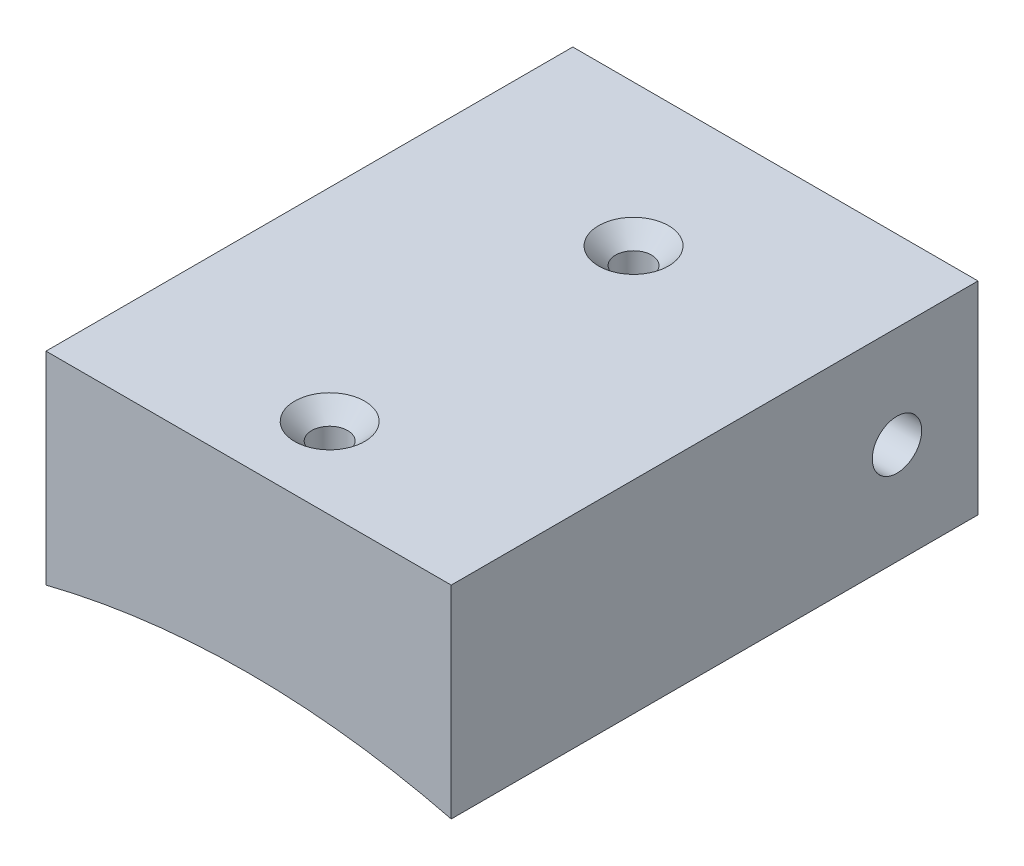
ISO-10303-21;
HEADER;
FILE_DESCRIPTION(('STEP AP214'),'2;1');
FILE_NAME('part.step','',(''),(''),'','','');
FILE_SCHEMA(('AUTOMOTIVE_DESIGN { 1 0 10303 214 1 1 1 1 }'));
ENDSEC;
DATA;
#1=APPLICATION_CONTEXT('core data for automotive mechanical design processes');
#2=APPLICATION_PROTOCOL_DEFINITION('international standard','automotive_design',2000,#1);
#3=PRODUCT_CONTEXT('',#1,'mechanical');
#4=PRODUCT('Part','Part','',(#3));
#5=PRODUCT_RELATED_PRODUCT_CATEGORY('part','',(#4));
#6=PRODUCT_DEFINITION_FORMATION('','',#4);
#7=PRODUCT_DEFINITION_CONTEXT('part definition',#1,'design');
#8=PRODUCT_DEFINITION('design','',#6,#7);
#9=PRODUCT_DEFINITION_SHAPE('','',#8);
#10=(LENGTH_UNIT() NAMED_UNIT(*) SI_UNIT(.MILLI.,.METRE.));
#11=(NAMED_UNIT(*) PLANE_ANGLE_UNIT() SI_UNIT($,.RADIAN.));
#12=(NAMED_UNIT(*) SI_UNIT($,.STERADIAN.) SOLID_ANGLE_UNIT());
#13=UNCERTAINTY_MEASURE_WITH_UNIT(LENGTH_MEASURE(1.E-05),#10,'distance_accuracy_value','');
#14=(GEOMETRIC_REPRESENTATION_CONTEXT(3) GLOBAL_UNCERTAINTY_ASSIGNED_CONTEXT((#13)) GLOBAL_UNIT_ASSIGNED_CONTEXT((#10,
#11,#12)) REPRESENTATION_CONTEXT('',''));
#15=CARTESIAN_POINT('',(0.,0.,0.));
#16=DIRECTION('',(0.,0.,1.));
#17=DIRECTION('',(1.,0.,0.));
#18=AXIS2_PLACEMENT_3D('',#15,#16,#17);
#19=CARTESIAN_POINT('',(10.,39.7782887515288,11.5));
#20=DIRECTION('',(-1.,0.,0.));
#21=DIRECTION('',(0.,-1.,0.));
#22=AXIS2_PLACEMENT_3D('',#19,#20,#21);
#23=PLANE('',#22);
#24=CARTESIAN_POINT('',(10.,44.7782887515288,-10.5));
#25=DIRECTION('',(-1.,0.,0.));
#26=DIRECTION('',(0.,0.,1.));
#27=AXIS2_PLACEMENT_3D('',#24,#25,#26);
#28=CIRCLE('',#27,1.2192);
#29=CARTESIAN_POINT('',(10.,44.7782887515288,-9.2808));
#30=VERTEX_POINT('',#29);
#31=EDGE_CURVE('E99',#30,#30,#28,.T.);
#32=ORIENTED_EDGE('',*,*,#31,.T.);
#33=EDGE_LOOP('',(#32));
#34=FACE_BOUND('',#33,.T.);
#35=DIRECTION('',(0.,0.,-1.));
#36=VECTOR('',#35,1.);
#37=CARTESIAN_POINT('',(9.99999999999999,39.7782887515288,11.5));
#38=LINE('',#37,#36);
#39=CARTESIAN_POINT('',(9.99999999999999,39.7782887515288,11.5));
#40=VERTEX_POINT('',#39);
#41=CARTESIAN_POINT('',(9.99999999999999,39.7782887515288,-14.5));
#42=VERTEX_POINT('',#41);
#43=EDGE_CURVE('E84',#40,#42,#38,.T.);
#44=ORIENTED_EDGE('',*,*,#43,.T.);
#45=DIRECTION('',(0.,-1.,0.));
#46=VECTOR('',#45,1.);
#47=CARTESIAN_POINT('',(9.99999999999999,49.7782887515288,-14.5));
#48=LINE('',#47,#46);
#49=CARTESIAN_POINT('',(9.99999999999999,49.7782887515288,-14.5));
#50=VERTEX_POINT('',#49);
#51=EDGE_CURVE('E98',#50,#42,#48,.T.);
#52=ORIENTED_EDGE('',*,*,#51,.F.);
#53=DIRECTION('',(0.,0.,-1.));
#54=VECTOR('',#53,1.);
#55=CARTESIAN_POINT('',(9.99999999999999,49.7782887515288,11.5));
#56=LINE('',#55,#54);
#57=CARTESIAN_POINT('',(9.99999999999999,49.7782887515288,11.5));
#58=VERTEX_POINT('',#57);
#59=EDGE_CURVE('E11',#58,#50,#56,.T.);
#60=ORIENTED_EDGE('',*,*,#59,.F.);
#61=DIRECTION('',(0.,1.,0.));
#62=VECTOR('',#61,1.);
#63=CARTESIAN_POINT('',(10.,39.7782887515288,11.5));
#64=LINE('',#63,#62);
#65=EDGE_CURVE('E121',#40,#58,#64,.T.);
#66=ORIENTED_EDGE('',*,*,#65,.F.);
#67=EDGE_LOOP('',(#44,#52,#60,#66));
#68=FACE_BOUND('',#67,.T.);
#69=ADVANCED_FACE('F34',(#34,#68),#23,.F.);
#70=CARTESIAN_POINT('',(-10.,49.7782887515288,11.5));
#71=DIRECTION('',(0.,-1.,0.));
#72=DIRECTION('',(0.,0.,-1.));
#73=AXIS2_PLACEMENT_3D('',#70,#71,#72);
#74=PLANE('',#73);
#75=CARTESIAN_POINT('',(0.,49.7782887515288,7.5));
#76=DIRECTION('',(0.,1.,0.));
#77=DIRECTION('',(0.,0.,1.));
#78=AXIS2_PLACEMENT_3D('',#75,#76,#77);
#79=CIRCLE('',#78,1.7272);
#80=CARTESIAN_POINT('',(0.,49.7782887515288,9.2272));
#81=VERTEX_POINT('',#80);
#82=EDGE_CURVE('E108',#81,#81,#79,.T.);
#83=ORIENTED_EDGE('',*,*,#82,.F.);
#84=EDGE_LOOP('',(#83));
#85=FACE_BOUND('',#84,.T.);
#86=CARTESIAN_POINT('',(0.,49.7782887515288,-7.5));
#87=DIRECTION('',(0.,1.,0.));
#88=DIRECTION('',(0.,0.,1.));
#89=AXIS2_PLACEMENT_3D('',#86,#87,#88);
#90=CIRCLE('',#89,1.7272);
#91=CARTESIAN_POINT('',(0.,49.7782887515288,-5.7728));
#92=VERTEX_POINT('',#91);
#93=EDGE_CURVE('E114',#92,#92,#90,.T.);
#94=ORIENTED_EDGE('',*,*,#93,.F.);
#95=EDGE_LOOP('',(#94));
#96=FACE_BOUND('',#95,.T.);
#97=ORIENTED_EDGE('',*,*,#59,.T.);
#98=DIRECTION('',(1.,0.,0.));
#99=VECTOR('',#98,1.);
#100=CARTESIAN_POINT('',(-10.,49.7782887515288,-14.5));
#101=LINE('',#100,#99);
#102=CARTESIAN_POINT('',(-10.,49.7782887515288,-14.5));
#103=VERTEX_POINT('',#102);
#104=EDGE_CURVE('E93',#103,#50,#101,.T.);
#105=ORIENTED_EDGE('',*,*,#104,.F.);
#106=DIRECTION('',(0.,0.,-1.));
#107=VECTOR('',#106,1.);
#108=CARTESIAN_POINT('',(-10.,49.7782887515288,11.5));
#109=LINE('',#108,#107);
#110=CARTESIAN_POINT('',(-10.,49.7782887515288,11.5));
#111=VERTEX_POINT('',#110);
#112=EDGE_CURVE('E46',#111,#103,#109,.T.);
#113=ORIENTED_EDGE('',*,*,#112,.F.);
#114=DIRECTION('',(-1.,0.,0.));
#115=VECTOR('',#114,1.);
#116=CARTESIAN_POINT('',(-10.,49.7782887515288,11.5));
#117=LINE('',#116,#115);
#118=EDGE_CURVE('E123',#58,#111,#117,.T.);
#119=ORIENTED_EDGE('',*,*,#118,.F.);
#120=EDGE_LOOP('',(#97,#105,#113,#119));
#121=FACE_BOUND('',#120,.T.);
#122=ADVANCED_FACE('F148',(#85,#96,#121),#74,.F.);
#123=CARTESIAN_POINT('',(-10.,39.7782887515288,11.5));
#124=DIRECTION('',(1.,0.,0.));
#125=DIRECTION('',(0.,0.,-1.));
#126=AXIS2_PLACEMENT_3D('',#123,#124,#125);
#127=PLANE('',#126);
#128=CARTESIAN_POINT('',(-10.,44.7782887515288,-10.5));
#129=DIRECTION('',(-1.,0.,0.));
#130=DIRECTION('',(0.,0.,1.));
#131=AXIS2_PLACEMENT_3D('',#128,#129,#130);
#132=CIRCLE('',#131,1.21919999999999);
#133=CARTESIAN_POINT('',(-10.,44.7782887515288,-9.28080000000001));
#134=VERTEX_POINT('',#133);
#135=EDGE_CURVE('E102',#134,#134,#132,.T.);
#136=ORIENTED_EDGE('',*,*,#135,.F.);
#137=EDGE_LOOP('',(#136));
#138=FACE_BOUND('',#137,.T.);
#139=ORIENTED_EDGE('',*,*,#112,.T.);
#140=DIRECTION('',(0.,1.,0.));
#141=VECTOR('',#140,1.);
#142=CARTESIAN_POINT('',(-10.,39.7782887515288,-14.5));
#143=LINE('',#142,#141);
#144=CARTESIAN_POINT('',(-10.,39.7782887515288,-14.5));
#145=VERTEX_POINT('',#144);
#146=EDGE_CURVE('E87',#145,#103,#143,.T.);
#147=ORIENTED_EDGE('',*,*,#146,.F.);
#148=DIRECTION('',(0.,0.,-1.));
#149=VECTOR('',#148,1.);
#150=CARTESIAN_POINT('',(-10.,39.7782887515288,11.5));
#151=LINE('',#150,#149);
#152=CARTESIAN_POINT('',(-10.,39.7782887515288,11.5));
#153=VERTEX_POINT('',#152);
#154=EDGE_CURVE('E78',#153,#145,#151,.T.);
#155=ORIENTED_EDGE('',*,*,#154,.F.);
#156=DIRECTION('',(0.,-1.,0.));
#157=VECTOR('',#156,1.);
#158=CARTESIAN_POINT('',(-10.,39.7782887515288,11.5));
#159=LINE('',#158,#157);
#160=EDGE_CURVE('E59',#111,#153,#159,.T.);
#161=ORIENTED_EDGE('',*,*,#160,.F.);
#162=EDGE_LOOP('',(#139,#147,#155,#161));
#163=FACE_BOUND('',#162,.T.);
#164=ADVANCED_FACE('F88',(#138,#163),#127,.F.);
#165=CARTESIAN_POINT('',(0.,0.,11.5));
#166=DIRECTION('',(0.,0.,-1.));
#167=DIRECTION('',(-1.,0.,0.));
#168=AXIS2_PLACEMENT_3D('',#165,#166,#167);
#169=CYLINDRICAL_SURFACE('',#168,41.016);
#170=CARTESIAN_POINT('',(0.,41.016,8.38899999999999));
#171=CARTESIAN_POINT('',(0.049929228932126,41.0159998699629,8.38899778778121));
#172=CARTESIAN_POINT('',(0.0998945119924177,41.015907852438,8.38477959341681));
#173=CARTESIAN_POINT('',(0.198448576668957,41.015549622233,8.36801115606778));
#174=CARTESIAN_POINT('',(0.247035635119785,41.0152832007195,8.35545092395971));
#175=CARTESIAN_POINT('',(0.341391215446925,41.0146063386537,8.32235652721126));
#176=CARTESIAN_POINT('',(0.387161088191506,41.0141959677689,8.30182621935944));
#177=CARTESIAN_POINT('',(0.474591784704374,41.0132775151121,8.25337987180758));
#178=CARTESIAN_POINT('',(0.516253617005182,41.0127694574131,8.22546565110197));
#179=CARTESIAN_POINT('',(0.594311311845111,41.0117126777415,8.16303337262704));
#180=CARTESIAN_POINT('',(0.63070584832166,41.0111639455812,8.12851365695993));
#181=CARTESIAN_POINT('',(0.697184826890335,41.0100877539512,8.05385276454074));
#182=CARTESIAN_POINT('',(0.727269019357758,41.0095602953236,8.01371136551071));
#183=CARTESIAN_POINT('',(0.780273917416403,41.0085861010333,7.9289435521529));
#184=CARTESIAN_POINT('',(0.803194051071216,41.0081393718167,7.88431678011491));
#185=CARTESIAN_POINT('',(0.841216396527763,41.0073770764913,7.79184760805361));
#186=CARTESIAN_POINT('',(0.856318632206063,41.0070615099819,7.74400521785159));
#187=CARTESIAN_POINT('',(0.878274248273316,41.0065971789132,7.64647082373414));
#188=CARTESIAN_POINT('',(0.885128926300777,41.0064483881142,7.59677911205243));
#189=CARTESIAN_POINT('',(0.890398836821576,41.0063343055997,7.49695008500877));
#190=CARTESIAN_POINT('',(0.888814094167344,41.0063690133438,7.44681277095947));
#191=CARTESIAN_POINT('',(0.877251269621314,41.0066179895149,7.34752456618097));
#192=CARTESIAN_POINT('',(0.867274596565945,41.0068322278023,7.29837351129666));
#193=CARTESIAN_POINT('',(0.839213287400361,41.0074160654385,7.20244405524221));
#194=CARTESIAN_POINT('',(0.821128637877032,41.0077856650443,7.15566565799733));
#195=CARTESIAN_POINT('',(0.777363120580765,41.0086385931355,7.06580489608492));
#196=CARTESIAN_POINT('',(0.751681606588388,41.0091219312953,7.02272284624572));
#197=CARTESIAN_POINT('',(0.693451860522382,41.0101478366362,6.9414811978651));
#198=CARTESIAN_POINT('',(0.660903621585196,41.0106904038765,6.90332160424393));
#199=CARTESIAN_POINT('',(0.589856374035643,41.0117737351151,6.83299986327303));
#200=CARTESIAN_POINT('',(0.551356141824823,41.0123144987192,6.80083895212647));
#201=CARTESIAN_POINT('',(0.469502120280667,41.0133331513295,6.74343703258392));
#202=CARTESIAN_POINT('',(0.426148330240262,41.0138110403266,6.71819602519603));
#203=CARTESIAN_POINT('',(0.335817190729818,41.0146500725386,6.6753505690518));
#204=CARTESIAN_POINT('',(0.288839823435064,41.0150112151792,6.65774615786342));
#205=CARTESIAN_POINT('',(0.192595369703212,41.0155760322317,6.6306744093296));
#206=CARTESIAN_POINT('',(0.143328286568394,41.0157797068706,6.62120706024909));
#207=CARTESIAN_POINT('',(0.0439136728550569,41.0160065984939,6.61067969430149));
#208=CARTESIAN_POINT('',(-0.00623367655049844,41.0160298521853,6.60961796729226));
#209=CARTESIAN_POINT('',(-0.105994735411967,41.0158933776377,6.61592752961438));
#210=CARTESIAN_POINT('',(-0.155608445178957,41.0157336495053,6.62329881402956));
#211=CARTESIAN_POINT('',(-0.252889092332219,41.0152492396543,6.64626373784688));
#212=CARTESIAN_POINT('',(-0.300556212789558,41.0149245734864,6.66185660210563));
#213=CARTESIAN_POINT('',(-0.392596181061378,41.0141468814526,6.70082126743296));
#214=CARTESIAN_POINT('',(-0.436969025619854,41.0136938554599,6.72419307619));
#215=CARTESIAN_POINT('',(-0.521168720110613,41.0127104059799,6.77805659071976));
#216=CARTESIAN_POINT('',(-0.560994833123272,41.0121799699779,6.80854944821692));
#217=CARTESIAN_POINT('',(-0.634963141510017,41.011101533048,6.8757877823353));
#218=CARTESIAN_POINT('',(-0.669105328213034,41.0105535320932,6.91253326849498));
#219=CARTESIAN_POINT('',(-0.730742293466598,41.0095016412428,6.9912410995548));
#220=CARTESIAN_POINT('',(-0.758235968387404,41.0089977586794,7.0332043088306));
#221=CARTESIAN_POINT('',(-0.805787898795439,41.0080910298517,7.12115194650953));
#222=CARTESIAN_POINT('',(-0.825846166787578,41.0076881834174,7.1671363681496));
#223=CARTESIAN_POINT('',(-0.857955977325155,41.0070289979468,7.26181692666611));
#224=CARTESIAN_POINT('',(-0.870008237535641,41.006772645779,7.31051282005977));
#225=CARTESIAN_POINT('',(-0.885766270259463,41.0064353141689,7.40923750950904));
#226=CARTESIAN_POINT('',(-0.889472039405653,41.0063543347973,7.45926630610234));
#227=CARTESIAN_POINT('',(-0.888431797244555,41.0063768838839,7.55922552260316));
#228=CARTESIAN_POINT('',(-0.883687532937697,41.0064803742038,7.60915596070928));
#229=CARTESIAN_POINT('',(-0.865885473884383,41.0068601156034,7.70751152072745));
#230=CARTESIAN_POINT('',(-0.852827662533469,41.0071363670281,7.75593663963277));
#231=CARTESIAN_POINT('',(-0.81876926650684,41.0078304848017,7.84990798304234));
#232=CARTESIAN_POINT('',(-0.797768539489769,41.0082483536885,7.89545415593725));
#233=CARTESIAN_POINT('',(-0.748421479376584,41.0091785776046,7.98237294865923));
#234=CARTESIAN_POINT('',(-0.72007542280097,41.009690929077,8.02374572551552));
#235=CARTESIAN_POINT('',(-0.656838846469199,41.0107524438683,8.10115031196175));
#236=CARTESIAN_POINT('',(-0.621947670314366,41.0113016108759,8.13718158521215));
#237=CARTESIAN_POINT('',(-0.546601301634042,41.0123749544836,8.20288456991222));
#238=CARTESIAN_POINT('',(-0.506144731057146,41.0128991248509,8.23255470160507));
#239=CARTESIAN_POINT('',(-0.420804377649847,41.0138635160648,8.28469588809415));
#240=CARTESIAN_POINT('',(-0.375918100580382,41.014303689201,8.30716285640101));
#241=CARTESIAN_POINT('',(-0.283044664011718,41.0150495454599,8.34421598715361));
#242=CARTESIAN_POINT('',(-0.235061288955561,41.0153553892847,8.3588115711596));
#243=CARTESIAN_POINT('',(-0.155644595158456,41.0157161573332,8.37582909110338));
#244=CARTESIAN_POINT('',(-0.124727023651672,41.0158221380771,8.38076199146602));
#245=CARTESIAN_POINT('',(-0.0625443514112362,41.0159641001375,8.38734813861129));
#246=CARTESIAN_POINT('',(-0.0312792507304226,41.0160000814645,8.38900138589253));
#247=CARTESIAN_POINT('',(0.,41.016,8.38899999999999));
#248=B_SPLINE_CURVE_WITH_KNOTS('',3,(#170,#171,#172,#173,#174,#175,#176,#177,#178,#179,#180,
#181,#182,#183,#184,#185,#186,#187,#188,#189,#190,#191,#192,#193,#194,#195,#196,#197,#198,#199,
#200,#201,#202,#203,#204,#205,#206,#207,#208,#209,#210,#211,#212,#213,#214,#215,#216,#217,#218,
#219,#220,#221,#222,#223,#224,#225,#226,#227,#228,#229,#230,#231,#232,#233,#234,#235,#236,#237,
#238,#239,#240,#241,#242,#243,#244,#245,#246,#247),.UNSPECIFIED.,.T.,.F.,(4,2,2,2,2,2,2,2,2,2,2,
2,2,2,2,2,2,2,2,2,2,2,2,2,2,2,2,2,2,2,2,2,2,2,2,2,2,2,4),(0.,0.149673515456884,
0.299526580487056,0.449307220533211,0.599050997085086,0.748832406892184,0.89861974063809,
1.04841902947315,1.19821786080499,1.34799312029053,1.49776793871771,1.64751761798068,
1.79726754497711,1.94703021396145,2.0967930326401,2.24658668029062,2.39638034976316,
2.54617475613174,2.69596894647014,2.84573266007034,2.99549628636322,3.14524579523179,
3.29499545210821,3.44476934557348,3.59454346752303,3.74434243441365,3.89414114937038,
4.04392643443581,4.19371177992769,4.34346616167362,4.49322084252153,4.64297820718173,
4.79272993493124,4.94249668905843,5.09230059401588,5.24218933576292,5.39189826951198,
5.48566451084175,5.57943073791576),.UNSPECIFIED.);
#249=CARTESIAN_POINT('',(0.,41.016,8.38899999999999));
#250=VERTEX_POINT('',#249);
#251=EDGE_CURVE('E37',#250,#250,#248,.T.);
#252=ORIENTED_EDGE('',*,*,#251,.T.);
#253=EDGE_LOOP('',(#252));
#254=FACE_BOUND('',#253,.T.);
#255=CARTESIAN_POINT('',(0.,41.016,-6.61100000000001));
#256=CARTESIAN_POINT('',(0.0499292289321234,41.0159998699629,-6.61100221221879));
#257=CARTESIAN_POINT('',(0.0998945119924151,41.015907852438,-6.61522040658319));
#258=CARTESIAN_POINT('',(0.198448576668954,41.015549622233,-6.63198884393222));
#259=CARTESIAN_POINT('',(0.247035635119782,41.0152832007195,-6.64454907604029));
#260=CARTESIAN_POINT('',(0.341391215446923,41.0146063386537,-6.67764347278874));
#261=CARTESIAN_POINT('',(0.387161088191504,41.0141959677689,-6.69817378064056));
#262=CARTESIAN_POINT('',(0.474591784704372,41.0132775151121,-6.74662012819242));
#263=CARTESIAN_POINT('',(0.51625361700518,41.0127694574131,-6.77453434889803));
#264=CARTESIAN_POINT('',(0.594311311845109,41.0117126777415,-6.83696662737297));
#265=CARTESIAN_POINT('',(0.630705848321658,41.0111639455812,-6.87148634304007));
#266=CARTESIAN_POINT('',(0.697184826890334,41.0100877539512,-6.94614723545926));
#267=CARTESIAN_POINT('',(0.727269019357756,41.0095602953236,-6.98628863448929));
#268=CARTESIAN_POINT('',(0.780273917416402,41.0085861010333,-7.0710564478471));
#269=CARTESIAN_POINT('',(0.803194051071214,41.0081393718167,-7.11568321988509));
#270=CARTESIAN_POINT('',(0.841216396527761,41.0073770764913,-7.20815239194639));
#271=CARTESIAN_POINT('',(0.856318632206061,41.0070615099819,-7.25599478214842));
#272=CARTESIAN_POINT('',(0.878274248273314,41.0065971789132,-7.35352917626586));
#273=CARTESIAN_POINT('',(0.885128926300774,41.0064483881142,-7.40322088794757));
#274=CARTESIAN_POINT('',(0.890398836821573,41.0063343055997,-7.50304991499123));
#275=CARTESIAN_POINT('',(0.888814094167342,41.0063690133438,-7.55318722904053));
#276=CARTESIAN_POINT('',(0.877251269621311,41.0066179895149,-7.65247543381903));
#277=CARTESIAN_POINT('',(0.867274596565942,41.0068322278023,-7.70162648870334));
#278=CARTESIAN_POINT('',(0.839213287400358,41.0074160654385,-7.79755594475779));
#279=CARTESIAN_POINT('',(0.821128637877029,41.0077856650443,-7.84433434200267));
#280=CARTESIAN_POINT('',(0.777363120580762,41.0086385931355,-7.93419510391508));
#281=CARTESIAN_POINT('',(0.751681606588384,41.0091219312953,-7.97727715375428));
#282=CARTESIAN_POINT('',(0.693451860522379,41.0101478366362,-8.0585188021349));
#283=CARTESIAN_POINT('',(0.660903621585192,41.0106904038765,-8.09667839575607));
#284=CARTESIAN_POINT('',(0.589856374035639,41.0117737351151,-8.16700013672697));
#285=CARTESIAN_POINT('',(0.55135614182482,41.0123144987192,-8.19916104787353));
#286=CARTESIAN_POINT('',(0.469502120280663,41.0133331513295,-8.25656296741608));
#287=CARTESIAN_POINT('',(0.426148330240259,41.0138110403266,-8.28180397480397));
#288=CARTESIAN_POINT('',(0.335817190729814,41.0146500725386,-8.3246494309482));
#289=CARTESIAN_POINT('',(0.28883982343506,41.0150112151792,-8.34225384213658));
#290=CARTESIAN_POINT('',(0.192595369703208,41.0155760322317,-8.3693255906704));
#291=CARTESIAN_POINT('',(0.143328286568391,41.0157797068706,-8.37879293975091));
#292=CARTESIAN_POINT('',(0.0439136728550537,41.0160065984939,-8.3893203056985));
#293=CARTESIAN_POINT('',(-0.00623367655050173,41.0160298521853,-8.39038203270774));
#294=CARTESIAN_POINT('',(-0.10599473541197,41.0158933776377,-8.38407247038562));
#295=CARTESIAN_POINT('',(-0.155608445178961,41.0157336495053,-8.37670118597044));
#296=CARTESIAN_POINT('',(-0.252889092332222,41.0152492396543,-8.35373626215312));
#297=CARTESIAN_POINT('',(-0.300556212789561,41.0149245734864,-8.33814339789437));
#298=CARTESIAN_POINT('',(-0.392596181061381,41.0141468814526,-8.29917873256704));
#299=CARTESIAN_POINT('',(-0.436969025619857,41.0136938554599,-8.27580692381));
#300=CARTESIAN_POINT('',(-0.521168720110616,41.0127104059799,-8.22194340928024));
#301=CARTESIAN_POINT('',(-0.560994833123276,41.0121799699779,-8.19145055178307));
#302=CARTESIAN_POINT('',(-0.634963141510021,41.011101533048,-8.1242122176647));
#303=CARTESIAN_POINT('',(-0.669105328213037,41.0105535320932,-8.08746673150501));
#304=CARTESIAN_POINT('',(-0.730742293466602,41.0095016412428,-8.0087589004452));
#305=CARTESIAN_POINT('',(-0.758235968387407,41.0089977586794,-7.9667956911694));
#306=CARTESIAN_POINT('',(-0.805787898795442,41.0080910298517,-7.87884805349047));
#307=CARTESIAN_POINT('',(-0.825846166787581,41.0076881834174,-7.8328636318504));
#308=CARTESIAN_POINT('',(-0.857955977325158,41.0070289979468,-7.73818307333389));
#309=CARTESIAN_POINT('',(-0.870008237535644,41.006772645779,-7.68948717994022));
#310=CARTESIAN_POINT('',(-0.885766270259466,41.0064353141689,-7.59076249049096));
#311=CARTESIAN_POINT('',(-0.889472039405656,41.0063543347973,-7.54073369389766));
#312=CARTESIAN_POINT('',(-0.888431797244558,41.0063768838839,-7.44077447739684));
#313=CARTESIAN_POINT('',(-0.883687532937699,41.0064803742038,-7.39084403929072));
#314=CARTESIAN_POINT('',(-0.865885473884386,41.0068601156034,-7.29248847927255));
#315=CARTESIAN_POINT('',(-0.852827662533471,41.0071363670281,-7.24406336036723));
#316=CARTESIAN_POINT('',(-0.818769266506843,41.0078304848017,-7.15009201695766));
#317=CARTESIAN_POINT('',(-0.797768539489771,41.0082483536885,-7.10454584406275));
#318=CARTESIAN_POINT('',(-0.748421479376587,41.0091785776046,-7.01762705134077));
#319=CARTESIAN_POINT('',(-0.720075422800972,41.009690929077,-6.97625427448448));
#320=CARTESIAN_POINT('',(-0.656838846469201,41.0107524438683,-6.89884968803825));
#321=CARTESIAN_POINT('',(-0.621947670314368,41.0113016108759,-6.86281841478784));
#322=CARTESIAN_POINT('',(-0.546601301634044,41.0123749544836,-6.79711543008778));
#323=CARTESIAN_POINT('',(-0.506144731057147,41.0128991248509,-6.76744529839492));
#324=CARTESIAN_POINT('',(-0.420804377649848,41.0138635160648,-6.71530411190585));
#325=CARTESIAN_POINT('',(-0.375918100580383,41.014303689201,-6.69283714359899));
#326=CARTESIAN_POINT('',(-0.283044664011719,41.0150495454599,-6.65578401284639));
#327=CARTESIAN_POINT('',(-0.235061288955563,41.0153553892847,-6.6411884288404));
#328=CARTESIAN_POINT('',(-0.155644595158459,41.0157161573332,-6.62417090889662));
#329=CARTESIAN_POINT('',(-0.124727023651674,41.0158221380771,-6.61923800853398));
#330=CARTESIAN_POINT('',(-0.0625443514112389,41.0159641001375,-6.61265186138871));
#331=CARTESIAN_POINT('',(-0.0312792507304252,41.0160000814645,-6.61099861410746));
#332=CARTESIAN_POINT('',(0.,41.016,-6.61100000000001));
#333=B_SPLINE_CURVE_WITH_KNOTS('',3,(#255,#256,#257,#258,#259,#260,#261,#262,#263,#264,#265,
#266,#267,#268,#269,#270,#271,#272,#273,#274,#275,#276,#277,#278,#279,#280,#281,#282,#283,#284,
#285,#286,#287,#288,#289,#290,#291,#292,#293,#294,#295,#296,#297,#298,#299,#300,#301,#302,#303,
#304,#305,#306,#307,#308,#309,#310,#311,#312,#313,#314,#315,#316,#317,#318,#319,#320,#321,#322,
#323,#324,#325,#326,#327,#328,#329,#330,#331,#332),.UNSPECIFIED.,.T.,.F.,(4,2,2,2,2,2,2,2,2,2,2,
2,2,2,2,2,2,2,2,2,2,2,2,2,2,2,2,2,2,2,2,2,2,2,2,2,2,2,4),(0.,0.149673515456884,
0.299526580487057,0.449307220533212,0.599050997085087,0.748832406892185,0.898619740638092,
1.04841902947316,1.19821786080499,1.34799312029053,1.49776793871771,1.64751761798068,
1.79726754497711,1.94703021396146,2.0967930326401,2.24658668029063,2.39638034976316,
2.54617475613174,2.69596894647014,2.84573266007035,2.99549628636322,3.1452457952318,
3.29499545210821,3.44476934557348,3.59454346752303,3.74434243441365,3.89414114937038,
4.04392643443581,4.1937117799277,4.34346616167362,4.49322084252153,4.64297820718173,
4.79272993493124,4.94249668905843,5.09230059401588,5.24218933576292,5.39189826951198,
5.48566451084175,5.57943073791576),.UNSPECIFIED.);
#334=CARTESIAN_POINT('',(0.,41.016,-6.61100000000001));
#335=VERTEX_POINT('',#334);
#336=EDGE_CURVE('E120',#335,#335,#333,.T.);
#337=ORIENTED_EDGE('',*,*,#336,.T.);
#338=EDGE_LOOP('',(#337));
#339=FACE_BOUND('',#338,.T.);
#340=ORIENTED_EDGE('',*,*,#154,.T.);
#341=CARTESIAN_POINT('',(0.,0.,-14.5));
#342=DIRECTION('',(0.,0.,1.));
#343=DIRECTION('',(-1.,0.,0.));
#344=AXIS2_PLACEMENT_3D('',#341,#342,#343);
#345=CIRCLE('',#344,41.016);
#346=EDGE_CURVE('E82',#42,#145,#345,.T.);
#347=ORIENTED_EDGE('',*,*,#346,.F.);
#348=ORIENTED_EDGE('',*,*,#43,.F.);
#349=CARTESIAN_POINT('',(0.,0.,11.5));
#350=DIRECTION('',(0.,0.,-1.));
#351=DIRECTION('',(1.,0.,0.));
#352=AXIS2_PLACEMENT_3D('',#349,#350,#351);
#353=CIRCLE('',#352,41.016);
#354=EDGE_CURVE('E54',#153,#40,#353,.T.);
#355=ORIENTED_EDGE('',*,*,#354,.F.);
#356=EDGE_LOOP('',(#340,#347,#348,#355));
#357=FACE_BOUND('',#356,.T.);
#358=ADVANCED_FACE('F80',(#254,#339,#357),#169,.F.);
#359=CARTESIAN_POINT('',(0.,0.,11.5));
#360=DIRECTION('',(0.,0.,1.));
#361=DIRECTION('',(1.,0.,0.));
#362=AXIS2_PLACEMENT_3D('',#359,#360,#361);
#363=PLANE('',#362);
#364=ORIENTED_EDGE('',*,*,#65,.T.);
#365=ORIENTED_EDGE('',*,*,#118,.T.);
#366=ORIENTED_EDGE('',*,*,#160,.T.);
#367=ORIENTED_EDGE('',*,*,#354,.T.);
#368=EDGE_LOOP('',(#364,#365,#366,#367));
#369=FACE_BOUND('',#368,.T.);
#370=ADVANCED_FACE('F140',(#369),#363,.T.);
#371=CARTESIAN_POINT('',(0.,49.7782887515288,-7.5));
#372=DIRECTION('',(0.,1.,0.));
#373=DIRECTION('',(0.,0.,1.));
#374=AXIS2_PLACEMENT_3D('',#371,#372,#373);
#375=CYLINDRICAL_SURFACE('',#374,0.888999999999992);
#376=CARTESIAN_POINT('',(0.,48.9400887515288,-7.5));
#377=DIRECTION('',(0.,1.,0.));
#378=DIRECTION('',(0.,0.,1.));
#379=AXIS2_PLACEMENT_3D('',#376,#377,#378);
#380=CIRCLE('',#379,0.888999999999987);
#381=CARTESIAN_POINT('',(0.,48.9400887515288,-6.61100000000001));
#382=VERTEX_POINT('',#381);
#383=EDGE_CURVE('E117',#382,#382,#380,.T.);
#384=ORIENTED_EDGE('',*,*,#383,.T.);
#385=EDGE_LOOP('',(#384));
#386=FACE_BOUND('',#385,.T.);
#387=ORIENTED_EDGE('',*,*,#336,.F.);
#388=EDGE_LOOP('',(#387));
#389=FACE_BOUND('',#388,.T.);
#390=ADVANCED_FACE('F135',(#386,#389),#375,.F.);
#391=CARTESIAN_POINT('',(0.,49.7782887515288,-7.5));
#392=DIRECTION('',(0.,1.,0.));
#393=DIRECTION('',(0.,0.,1.));
#394=AXIS2_PLACEMENT_3D('',#391,#392,#393);
#395=CONICAL_SURFACE('',#394,1.7272,0.785398163397449);
#396=ORIENTED_EDGE('',*,*,#383,.F.);
#397=EDGE_LOOP('',(#396));
#398=FACE_BOUND('',#397,.T.);
#399=ORIENTED_EDGE('',*,*,#93,.T.);
#400=EDGE_LOOP('',(#399));
#401=FACE_BOUND('',#400,.T.);
#402=ADVANCED_FACE('F139',(#398,#401),#395,.F.);
#403=CARTESIAN_POINT('',(0.,49.7782887515288,7.5));
#404=DIRECTION('',(0.,1.,0.));
#405=DIRECTION('',(0.,0.,1.));
#406=AXIS2_PLACEMENT_3D('',#403,#404,#405);
#407=CYLINDRICAL_SURFACE('',#406,0.888999999999992);
#408=CARTESIAN_POINT('',(0.,48.9400887515288,7.5));
#409=DIRECTION('',(0.,1.,0.));
#410=DIRECTION('',(0.,0.,1.));
#411=AXIS2_PLACEMENT_3D('',#408,#409,#410);
#412=CIRCLE('',#411,0.888999999999987);
#413=CARTESIAN_POINT('',(0.,48.9400887515288,8.38899999999999));
#414=VERTEX_POINT('',#413);
#415=EDGE_CURVE('E111',#414,#414,#412,.T.);
#416=ORIENTED_EDGE('',*,*,#415,.T.);
#417=EDGE_LOOP('',(#416));
#418=FACE_BOUND('',#417,.T.);
#419=ORIENTED_EDGE('',*,*,#251,.F.);
#420=EDGE_LOOP('',(#419));
#421=FACE_BOUND('',#420,.T.);
#422=ADVANCED_FACE('F234',(#418,#421),#407,.F.);
#423=CARTESIAN_POINT('',(0.,49.7782887515288,7.5));
#424=DIRECTION('',(0.,1.,0.));
#425=DIRECTION('',(0.,0.,1.));
#426=AXIS2_PLACEMENT_3D('',#423,#424,#425);
#427=CONICAL_SURFACE('',#426,1.7272,0.785398163397449);
#428=ORIENTED_EDGE('',*,*,#415,.F.);
#429=EDGE_LOOP('',(#428));
#430=FACE_BOUND('',#429,.T.);
#431=ORIENTED_EDGE('',*,*,#82,.T.);
#432=EDGE_LOOP('',(#431));
#433=FACE_BOUND('',#432,.T.);
#434=ADVANCED_FACE('F189',(#430,#433),#427,.F.);
#435=CARTESIAN_POINT('',(0.,0.,-14.5));
#436=DIRECTION('',(0.,0.,-1.));
#437=DIRECTION('',(-1.,0.,0.));
#438=AXIS2_PLACEMENT_3D('',#435,#436,#437);
#439=PLANE('',#438);
#440=ORIENTED_EDGE('',*,*,#346,.T.);
#441=ORIENTED_EDGE('',*,*,#146,.T.);
#442=ORIENTED_EDGE('',*,*,#104,.T.);
#443=ORIENTED_EDGE('',*,*,#51,.T.);
#444=EDGE_LOOP('',(#440,#441,#442,#443));
#445=FACE_BOUND('',#444,.T.);
#446=ADVANCED_FACE('F96',(#445),#439,.T.);
#447=CARTESIAN_POINT('',(-10.,44.7782887515288,-10.5));
#448=DIRECTION('',(-1.,0.,0.));
#449=DIRECTION('',(0.,0.,1.));
#450=AXIS2_PLACEMENT_3D('',#447,#448,#449);
#451=CYLINDRICAL_SURFACE('',#450,1.21919999999999);
#452=ORIENTED_EDGE('',*,*,#31,.F.);
#453=EDGE_LOOP('',(#452));
#454=FACE_BOUND('',#453,.T.);
#455=ORIENTED_EDGE('',*,*,#135,.T.);
#456=EDGE_LOOP('',(#455));
#457=FACE_BOUND('',#456,.T.);
#458=ADVANCED_FACE('F160',(#454,#457),#451,.F.);
#459=CLOSED_SHELL('',(#69,#122,#164,#358,#370,#390,#402,#422,#434,#446,#458));
#460=MANIFOLD_SOLID_BREP('B2',#459);
#461=ADVANCED_BREP_SHAPE_REPRESENTATION('',(#18,#460),#14);
#462=SHAPE_DEFINITION_REPRESENTATION(#9,#461);
ENDSEC;
END-ISO-10303-21;
